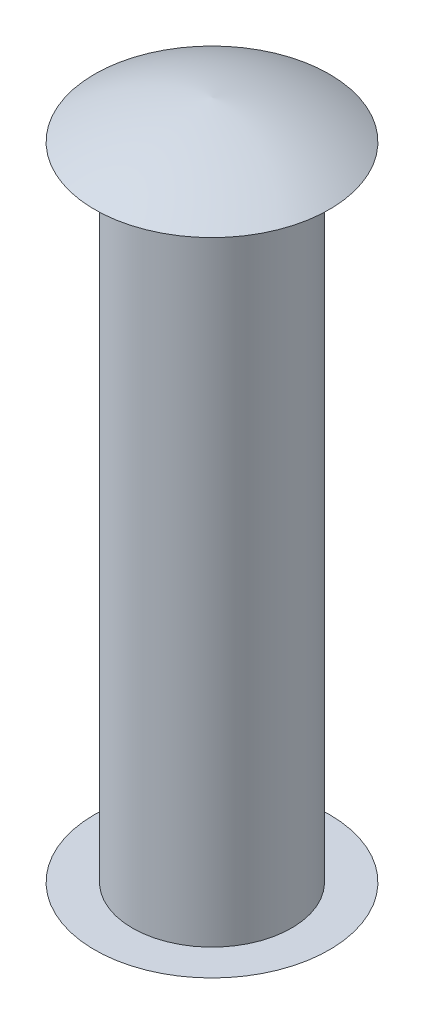
ISO-10303-21;
HEADER;
FILE_DESCRIPTION(('STEP AP214'),'2;1');
FILE_NAME('part.step','',(''),(''),'','','');
FILE_SCHEMA(('AUTOMOTIVE_DESIGN { 1 0 10303 214 1 1 1 1 }'));
ENDSEC;
DATA;
#1=APPLICATION_CONTEXT('core data for automotive mechanical design processes');
#2=APPLICATION_PROTOCOL_DEFINITION('international standard','automotive_design',2000,#1);
#3=PRODUCT_CONTEXT('',#1,'mechanical');
#4=PRODUCT('Part','Part','',(#3));
#5=PRODUCT_RELATED_PRODUCT_CATEGORY('part','',(#4));
#6=PRODUCT_DEFINITION_FORMATION('','',#4);
#7=PRODUCT_DEFINITION_CONTEXT('part definition',#1,'design');
#8=PRODUCT_DEFINITION('design','',#6,#7);
#9=PRODUCT_DEFINITION_SHAPE('','',#8);
#10=(LENGTH_UNIT() NAMED_UNIT(*) SI_UNIT(.MILLI.,.METRE.));
#11=(NAMED_UNIT(*) PLANE_ANGLE_UNIT() SI_UNIT($,.RADIAN.));
#12=(NAMED_UNIT(*) SI_UNIT($,.STERADIAN.) SOLID_ANGLE_UNIT());
#13=UNCERTAINTY_MEASURE_WITH_UNIT(LENGTH_MEASURE(1.E-05),#10,'distance_accuracy_value','');
#14=(GEOMETRIC_REPRESENTATION_CONTEXT(3) GLOBAL_UNCERTAINTY_ASSIGNED_CONTEXT((#13)) GLOBAL_UNIT_ASSIGNED_CONTEXT((#10,
#11,#12)) REPRESENTATION_CONTEXT('',''));
#15=CARTESIAN_POINT('',(0.,0.,0.));
#16=DIRECTION('',(0.,0.,1.));
#17=DIRECTION('',(1.,0.,0.));
#18=AXIS2_PLACEMENT_3D('',#15,#16,#17);
#19=CARTESIAN_POINT('',(0.,12.7889,0.));
#20=DIRECTION('',(0.,-1.,0.));
#21=DIRECTION('',(0.,0.,-1.));
#22=AXIS2_PLACEMENT_3D('',#19,#20,#21);
#23=CYLINDRICAL_SURFACE('',#22,3.175);
#24=CARTESIAN_POINT('',(0.,12.7889,0.));
#25=DIRECTION('',(0.,1.,0.));
#26=DIRECTION('',(0.,0.,1.));
#27=AXIS2_PLACEMENT_3D('',#24,#25,#26);
#28=CIRCLE('',#27,3.175);
#29=CARTESIAN_POINT('',(0.,12.7889,3.175));
#30=VERTEX_POINT('',#29);
#31=EDGE_CURVE('E11',#30,#30,#28,.T.);
#32=ORIENTED_EDGE('',*,*,#31,.F.);
#33=EDGE_LOOP('',(#32));
#34=FACE_BOUND('',#33,.T.);
#35=CARTESIAN_POINT('',(0.,-12.7889,0.));
#36=DIRECTION('',(0.,1.,0.));
#37=DIRECTION('',(0.,0.,1.));
#38=AXIS2_PLACEMENT_3D('',#35,#36,#37);
#39=CIRCLE('',#38,3.175);
#40=CARTESIAN_POINT('',(0.,-12.7889,3.175));
#41=VERTEX_POINT('',#40);
#42=EDGE_CURVE('E42',#41,#41,#39,.T.);
#43=ORIENTED_EDGE('',*,*,#42,.T.);
#44=EDGE_LOOP('',(#43));
#45=FACE_BOUND('',#44,.T.);
#46=ADVANCED_FACE('F39',(#34,#45),#23,.T.);
#47=CARTESIAN_POINT('',(0.,14.3129,0.));
#48=CARTESIAN_POINT('',(-2.48568735162812,14.0674632831603,0.));
#49=CARTESIAN_POINT('',(-4.68122,12.7889,0.));
#50=B_SPLINE_CURVE_WITH_KNOTS('',2,(#47,#48,#49),.UNSPECIFIED.,.F.,.F.,(3,3),(0.,1.),.UNSPECIFIED.);
#51=CARTESIAN_POINT('',(0.,12.7889,0.));
#52=DIRECTION('',(0.,-1.,0.));
#53=AXIS1_PLACEMENT('',#51,#52);
#54=SURFACE_OF_REVOLUTION('',#50,#53);
#55=CARTESIAN_POINT('',(0.,12.7889,0.));
#56=DIRECTION('',(0.,-1.,0.));
#57=DIRECTION('',(0.,0.,-1.));
#58=AXIS2_PLACEMENT_3D('',#55,#56,#57);
#59=CIRCLE('',#58,4.68122);
#60=CARTESIAN_POINT('',(0.,12.7889,-4.68122));
#61=VERTEX_POINT('',#60);
#62=EDGE_CURVE('E48',#61,#61,#59,.T.);
#63=ORIENTED_EDGE('',*,*,#62,.F.);
#64=EDGE_LOOP('',(#63));
#65=FACE_BOUND('',#64,.T.);
#66=CARTESIAN_POINT('',(0.,14.3129,0.));
#67=VERTEX_POINT('',#66);
#68=VERTEX_LOOP('',#67);
#69=FACE_BOUND('',#68,.T.);
#70=ADVANCED_FACE('F66',(#65,#69),#54,.T.);
#71=CARTESIAN_POINT('',(0.,12.7889,0.));
#72=DIRECTION('',(0.,1.,0.));
#73=DIRECTION('',(0.,0.,1.));
#74=AXIS2_PLACEMENT_3D('',#71,#72,#73);
#75=PLANE('',#74);
#76=ORIENTED_EDGE('',*,*,#31,.T.);
#77=EDGE_LOOP('',(#76));
#78=FACE_BOUND('',#77,.T.);
#79=ORIENTED_EDGE('',*,*,#62,.T.);
#80=EDGE_LOOP('',(#79));
#81=FACE_BOUND('',#80,.T.);
#82=ADVANCED_FACE('F57',(#78,#81),#75,.F.);
#83=CARTESIAN_POINT('',(0.,-14.3129,0.));
#84=CARTESIAN_POINT('',(-2.48568735162812,-14.0674632831603,0.));
#85=CARTESIAN_POINT('',(-4.68122,-12.7889,0.));
#86=B_SPLINE_CURVE_WITH_KNOTS('',2,(#83,#84,#85),.UNSPECIFIED.,.F.,.F.,(3,3),(0.,1.),.UNSPECIFIED.);
#87=CARTESIAN_POINT('',(0.,-12.7889,0.));
#88=DIRECTION('',(0.,1.,0.));
#89=AXIS1_PLACEMENT('',#87,#88);
#90=SURFACE_OF_REVOLUTION('',#86,#89);
#91=CARTESIAN_POINT('',(0.,-12.7889,0.));
#92=DIRECTION('',(0.,-1.,0.));
#93=DIRECTION('',(0.,0.,-1.));
#94=AXIS2_PLACEMENT_3D('',#91,#92,#93);
#95=CIRCLE('',#94,4.68122);
#96=CARTESIAN_POINT('',(0.,-12.7889,-4.68122));
#97=VERTEX_POINT('',#96);
#98=EDGE_CURVE('E82',#97,#97,#95,.T.);
#99=ORIENTED_EDGE('',*,*,#98,.T.);
#100=EDGE_LOOP('',(#99));
#101=FACE_BOUND('',#100,.T.);
#102=CARTESIAN_POINT('',(0.,-14.3129,0.));
#103=VERTEX_POINT('',#102);
#104=VERTEX_LOOP('',#103);
#105=FACE_BOUND('',#104,.T.);
#106=ADVANCED_FACE('F54',(#101,#105),#90,.T.);
#107=CARTESIAN_POINT('',(0.,-12.7889,0.));
#108=DIRECTION('',(0.,-1.,0.));
#109=DIRECTION('',(0.,0.,1.));
#110=AXIS2_PLACEMENT_3D('',#107,#108,#109);
#111=PLANE('',#110);
#112=ORIENTED_EDGE('',*,*,#42,.F.);
#113=EDGE_LOOP('',(#112));
#114=FACE_BOUND('',#113,.T.);
#115=ORIENTED_EDGE('',*,*,#98,.F.);
#116=EDGE_LOOP('',(#115));
#117=FACE_BOUND('',#116,.T.);
#118=ADVANCED_FACE('F56',(#114,#117),#111,.F.);
#119=CLOSED_SHELL('',(#46,#70,#82,#106,#118));
#120=MANIFOLD_SOLID_BREP('B2',#119);
#121=ADVANCED_BREP_SHAPE_REPRESENTATION('',(#18,#120),#14);
#122=SHAPE_DEFINITION_REPRESENTATION(#9,#121);
ENDSEC;
END-ISO-10303-21;
